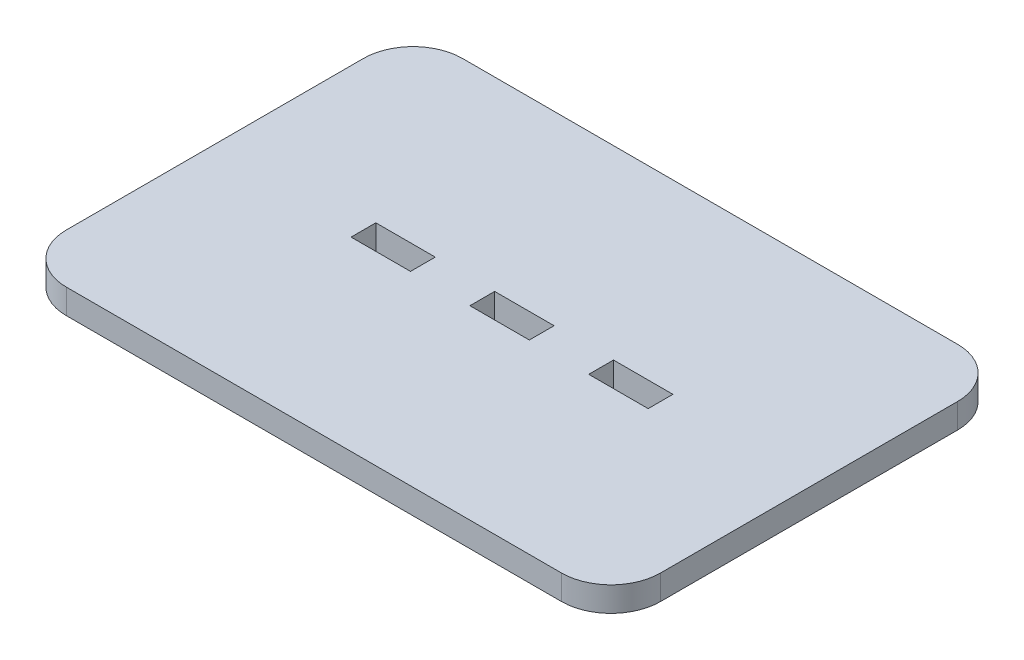
ISO-10303-21;
HEADER;
FILE_DESCRIPTION(('STEP AP214'),'2;1');
FILE_NAME('part.step','',(''),(''),'','','');
FILE_SCHEMA(('AUTOMOTIVE_DESIGN { 1 0 10303 214 1 1 1 1 }'));
ENDSEC;
DATA;
#1=APPLICATION_CONTEXT('core data for automotive mechanical design processes');
#2=APPLICATION_PROTOCOL_DEFINITION('international standard','automotive_design',2000,#1);
#3=PRODUCT_CONTEXT('',#1,'mechanical');
#4=PRODUCT('Part','Part','',(#3));
#5=PRODUCT_RELATED_PRODUCT_CATEGORY('part','',(#4));
#6=PRODUCT_DEFINITION_FORMATION('','',#4);
#7=PRODUCT_DEFINITION_CONTEXT('part definition',#1,'design');
#8=PRODUCT_DEFINITION('design','',#6,#7);
#9=PRODUCT_DEFINITION_SHAPE('','',#8);
#10=(LENGTH_UNIT() NAMED_UNIT(*) SI_UNIT(.MILLI.,.METRE.));
#11=(NAMED_UNIT(*) PLANE_ANGLE_UNIT() SI_UNIT($,.RADIAN.));
#12=(NAMED_UNIT(*) SI_UNIT($,.STERADIAN.) SOLID_ANGLE_UNIT());
#13=UNCERTAINTY_MEASURE_WITH_UNIT(LENGTH_MEASURE(1.E-05),#10,'distance_accuracy_value','');
#14=(GEOMETRIC_REPRESENTATION_CONTEXT(3) GLOBAL_UNCERTAINTY_ASSIGNED_CONTEXT((#13)) GLOBAL_UNIT_ASSIGNED_CONTEXT((#10,
#11,#12)) REPRESENTATION_CONTEXT('',''));
#15=CARTESIAN_POINT('',(0.,0.,0.));
#16=DIRECTION('',(0.,0.,1.));
#17=DIRECTION('',(1.,0.,0.));
#18=AXIS2_PLACEMENT_3D('',#15,#16,#17);
#19=CARTESIAN_POINT('',(50.,5.,-30.));
#20=DIRECTION('',(0.,-1.,0.));
#21=DIRECTION('',(0.,0.,-1.));
#22=AXIS2_PLACEMENT_3D('',#19,#20,#21);
#23=PLANE('',#22);
#24=DIRECTION('',(0.,0.,1.));
#25=VECTOR('',#24,1.);
#26=CARTESIAN_POINT('',(-30.,5.,-2.50000000000001));
#27=LINE('',#26,#25);
#28=CARTESIAN_POINT('',(-30.,5.,-2.50000000000001));
#29=VERTEX_POINT('',#28);
#30=CARTESIAN_POINT('',(-30.,5.,2.49999999999999));
#31=VERTEX_POINT('',#30);
#32=EDGE_CURVE('E205',#29,#31,#27,.T.);
#33=ORIENTED_EDGE('',*,*,#32,.F.);
#34=DIRECTION('',(-1.,0.,0.));
#35=VECTOR('',#34,1.);
#36=CARTESIAN_POINT('',(-30.,5.,-2.50000000000001));
#37=LINE('',#36,#35);
#38=CARTESIAN_POINT('',(-18.,5.,-2.50000000000002));
#39=VERTEX_POINT('',#38);
#40=EDGE_CURVE('E213',#39,#29,#37,.T.);
#41=ORIENTED_EDGE('',*,*,#40,.F.);
#42=DIRECTION('',(0.,0.,-1.));
#43=VECTOR('',#42,1.);
#44=CARTESIAN_POINT('',(-18.,5.,-2.50000000000001));
#45=LINE('',#44,#43);
#46=CARTESIAN_POINT('',(-18.,5.,2.49999999999999));
#47=VERTEX_POINT('',#46);
#48=EDGE_CURVE('E210',#47,#39,#45,.T.);
#49=ORIENTED_EDGE('',*,*,#48,.F.);
#50=DIRECTION('',(1.,0.,0.));
#51=VECTOR('',#50,1.);
#52=CARTESIAN_POINT('',(-30.,5.,2.49999999999999));
#53=LINE('',#52,#51);
#54=EDGE_CURVE('E207',#31,#47,#53,.T.);
#55=ORIENTED_EDGE('',*,*,#54,.F.);
#56=EDGE_LOOP('',(#33,#41,#49,#55));
#57=FACE_BOUND('',#56,.T.);
#58=CARTESIAN_POINT('',(50.,5.,-30.));
#59=DIRECTION('',(0.,1.,0.));
#60=DIRECTION('',(0.,0.,-1.));
#61=AXIS2_PLACEMENT_3D('',#58,#59,#60);
#62=CIRCLE('',#61,10.);
#63=CARTESIAN_POINT('',(60.,5.,-29.9999999999999));
#64=VERTEX_POINT('',#63);
#65=CARTESIAN_POINT('',(49.9999999999999,5.,-40.));
#66=VERTEX_POINT('',#65);
#67=EDGE_CURVE('E267',#64,#66,#62,.T.);
#68=ORIENTED_EDGE('',*,*,#67,.T.);
#69=DIRECTION('',(-1.,0.,0.));
#70=VECTOR('',#69,1.);
#71=CARTESIAN_POINT('',(-49.9999999999999,5.,-40.));
#72=LINE('',#71,#70);
#73=CARTESIAN_POINT('',(-49.9999999999999,5.,-40.));
#74=VERTEX_POINT('',#73);
#75=EDGE_CURVE('E270',#66,#74,#72,.T.);
#76=ORIENTED_EDGE('',*,*,#75,.T.);
#77=CARTESIAN_POINT('',(-50.,5.,-30.));
#78=DIRECTION('',(0.,1.,0.));
#79=DIRECTION('',(0.,0.,1.));
#80=AXIS2_PLACEMENT_3D('',#77,#78,#79);
#81=CIRCLE('',#80,10.);
#82=CARTESIAN_POINT('',(-60.,5.,-29.9999999999999));
#83=VERTEX_POINT('',#82);
#84=EDGE_CURVE('E273',#74,#83,#81,.T.);
#85=ORIENTED_EDGE('',*,*,#84,.T.);
#86=DIRECTION('',(0.,0.,1.));
#87=VECTOR('',#86,1.);
#88=CARTESIAN_POINT('',(-60.,5.,-29.9999999999999));
#89=LINE('',#88,#87);
#90=CARTESIAN_POINT('',(-60.,5.,29.9999999999999));
#91=VERTEX_POINT('',#90);
#92=EDGE_CURVE('E275',#83,#91,#89,.T.);
#93=ORIENTED_EDGE('',*,*,#92,.T.);
#94=CARTESIAN_POINT('',(-50.,5.,30.));
#95=DIRECTION('',(0.,1.,0.));
#96=DIRECTION('',(0.,0.,-1.));
#97=AXIS2_PLACEMENT_3D('',#94,#95,#96);
#98=CIRCLE('',#97,10.);
#99=CARTESIAN_POINT('',(-49.9999999999999,5.,40.));
#100=VERTEX_POINT('',#99);
#101=EDGE_CURVE('E277',#91,#100,#98,.T.);
#102=ORIENTED_EDGE('',*,*,#101,.T.);
#103=DIRECTION('',(1.,0.,0.));
#104=VECTOR('',#103,1.);
#105=CARTESIAN_POINT('',(-49.9999999999999,5.,40.));
#106=LINE('',#105,#104);
#107=CARTESIAN_POINT('',(49.9999999999999,5.,40.));
#108=VERTEX_POINT('',#107);
#109=EDGE_CURVE('E279',#100,#108,#106,.T.);
#110=ORIENTED_EDGE('',*,*,#109,.T.);
#111=CARTESIAN_POINT('',(50.,5.,30.));
#112=DIRECTION('',(0.,1.,0.));
#113=DIRECTION('',(0.,0.,-1.));
#114=AXIS2_PLACEMENT_3D('',#111,#112,#113);
#115=CIRCLE('',#114,10.);
#116=CARTESIAN_POINT('',(60.,5.,29.9999999999999));
#117=VERTEX_POINT('',#116);
#118=EDGE_CURVE('E281',#108,#117,#115,.T.);
#119=ORIENTED_EDGE('',*,*,#118,.T.);
#120=DIRECTION('',(0.,0.,-1.));
#121=VECTOR('',#120,1.);
#122=CARTESIAN_POINT('',(60.,5.,-29.9999999999999));
#123=LINE('',#122,#121);
#124=EDGE_CURVE('E283',#117,#64,#123,.T.);
#125=ORIENTED_EDGE('',*,*,#124,.T.);
#126=EDGE_LOOP('',(#68,#76,#85,#93,#102,#110,#119,#125));
#127=FACE_BOUND('',#126,.T.);
#128=DIRECTION('',(1.,0.,0.));
#129=VECTOR('',#128,1.);
#130=CARTESIAN_POINT('',(18.,5.,2.49999999999999));
#131=LINE('',#130,#129);
#132=CARTESIAN_POINT('',(18.,5.,2.49999999999999));
#133=VERTEX_POINT('',#132);
#134=CARTESIAN_POINT('',(30.,5.,2.49999999999999));
#135=VERTEX_POINT('',#134);
#136=EDGE_CURVE('E236',#133,#135,#131,.T.);
#137=ORIENTED_EDGE('',*,*,#136,.F.);
#138=DIRECTION('',(0.,0.,1.));
#139=VECTOR('',#138,1.);
#140=CARTESIAN_POINT('',(18.,5.,-2.50000000000001));
#141=LINE('',#140,#139);
#142=CARTESIAN_POINT('',(18.,5.,-2.50000000000001));
#143=VERTEX_POINT('',#142);
#144=EDGE_CURVE('E244',#143,#133,#141,.T.);
#145=ORIENTED_EDGE('',*,*,#144,.F.);
#146=DIRECTION('',(-1.,0.,0.));
#147=VECTOR('',#146,1.);
#148=CARTESIAN_POINT('',(18.,5.,-2.50000000000001));
#149=LINE('',#148,#147);
#150=CARTESIAN_POINT('',(30.,5.,-2.50000000000001));
#151=VERTEX_POINT('',#150);
#152=EDGE_CURVE('E241',#151,#143,#149,.T.);
#153=ORIENTED_EDGE('',*,*,#152,.F.);
#154=DIRECTION('',(0.,0.,-1.));
#155=VECTOR('',#154,1.);
#156=CARTESIAN_POINT('',(30.,5.,-2.50000000000001));
#157=LINE('',#156,#155);
#158=EDGE_CURVE('E238',#135,#151,#157,.T.);
#159=ORIENTED_EDGE('',*,*,#158,.F.);
#160=EDGE_LOOP('',(#137,#145,#153,#159));
#161=FACE_BOUND('',#160,.T.);
#162=DIRECTION('',(1.,0.,0.));
#163=VECTOR('',#162,1.);
#164=CARTESIAN_POINT('',(-6.00000000000001,5.,2.49999999999999));
#165=LINE('',#164,#163);
#166=CARTESIAN_POINT('',(-6.00000000000001,5.,2.49999999999999));
#167=VERTEX_POINT('',#166);
#168=CARTESIAN_POINT('',(5.99999999999999,5.,2.49999999999999));
#169=VERTEX_POINT('',#168);
#170=EDGE_CURVE('E169',#167,#169,#165,.T.);
#171=ORIENTED_EDGE('',*,*,#170,.F.);
#172=DIRECTION('',(0.,0.,1.));
#173=VECTOR('',#172,1.);
#174=CARTESIAN_POINT('',(-6.00000000000001,5.,-2.50000000000001));
#175=LINE('',#174,#173);
#176=CARTESIAN_POINT('',(-6.00000000000001,5.,-2.50000000000001));
#177=VERTEX_POINT('',#176);
#178=EDGE_CURVE('E191',#177,#167,#175,.T.);
#179=ORIENTED_EDGE('',*,*,#178,.F.);
#180=DIRECTION('',(-1.,0.,0.));
#181=VECTOR('',#180,1.);
#182=CARTESIAN_POINT('',(-6.00000000000001,5.,-2.50000000000001));
#183=LINE('',#182,#181);
#184=CARTESIAN_POINT('',(5.99999999999999,5.,-2.50000000000001));
#185=VERTEX_POINT('',#184);
#186=EDGE_CURVE('E189',#185,#177,#183,.T.);
#187=ORIENTED_EDGE('',*,*,#186,.F.);
#188=DIRECTION('',(0.,0.,-1.));
#189=VECTOR('',#188,1.);
#190=CARTESIAN_POINT('',(5.99999999999999,5.,-2.50000000000001));
#191=LINE('',#190,#189);
#192=EDGE_CURVE('E177',#169,#185,#191,.T.);
#193=ORIENTED_EDGE('',*,*,#192,.F.);
#194=EDGE_LOOP('',(#171,#179,#187,#193));
#195=FACE_BOUND('',#194,.T.);
#196=ADVANCED_FACE('F32',(#57,#127,#161,#195),#23,.F.);
#197=CARTESIAN_POINT('',(50.,0.,-30.));
#198=DIRECTION('',(0.,-1.,0.));
#199=DIRECTION('',(0.,0.,-1.));
#200=AXIS2_PLACEMENT_3D('',#197,#198,#199);
#201=PLANE('',#200);
#202=CARTESIAN_POINT('',(50.,0.,-30.));
#203=DIRECTION('',(0.,1.,0.));
#204=DIRECTION('',(0.,0.,-1.));
#205=AXIS2_PLACEMENT_3D('',#202,#203,#204);
#206=CIRCLE('',#205,10.);
#207=CARTESIAN_POINT('',(60.,0.,-29.9999999999999));
#208=VERTEX_POINT('',#207);
#209=CARTESIAN_POINT('',(49.9999999999999,0.,-40.));
#210=VERTEX_POINT('',#209);
#211=EDGE_CURVE('E266',#208,#210,#206,.T.);
#212=ORIENTED_EDGE('',*,*,#211,.F.);
#213=DIRECTION('',(0.,0.,-1.));
#214=VECTOR('',#213,1.);
#215=CARTESIAN_POINT('',(60.,0.,-29.9999999999999));
#216=LINE('',#215,#214);
#217=CARTESIAN_POINT('',(60.,0.,29.9999999999999));
#218=VERTEX_POINT('',#217);
#219=EDGE_CURVE('E271',#218,#208,#216,.T.);
#220=ORIENTED_EDGE('',*,*,#219,.F.);
#221=CARTESIAN_POINT('',(50.,0.,30.));
#222=DIRECTION('',(0.,1.,0.));
#223=DIRECTION('',(0.,0.,-1.));
#224=AXIS2_PLACEMENT_3D('',#221,#222,#223);
#225=CIRCLE('',#224,10.);
#226=CARTESIAN_POINT('',(49.9999999999999,0.,40.));
#227=VERTEX_POINT('',#226);
#228=EDGE_CURVE('E298',#227,#218,#225,.T.);
#229=ORIENTED_EDGE('',*,*,#228,.F.);
#230=DIRECTION('',(1.,0.,0.));
#231=VECTOR('',#230,1.);
#232=CARTESIAN_POINT('',(-49.9999999999999,0.,40.));
#233=LINE('',#232,#231);
#234=CARTESIAN_POINT('',(-49.9999999999999,0.,40.));
#235=VERTEX_POINT('',#234);
#236=EDGE_CURVE('E296',#235,#227,#233,.T.);
#237=ORIENTED_EDGE('',*,*,#236,.F.);
#238=CARTESIAN_POINT('',(-50.,0.,30.));
#239=DIRECTION('',(0.,1.,0.));
#240=DIRECTION('',(0.,0.,-1.));
#241=AXIS2_PLACEMENT_3D('',#238,#239,#240);
#242=CIRCLE('',#241,10.);
#243=CARTESIAN_POINT('',(-60.,0.,29.9999999999999));
#244=VERTEX_POINT('',#243);
#245=EDGE_CURVE('E294',#244,#235,#242,.T.);
#246=ORIENTED_EDGE('',*,*,#245,.F.);
#247=DIRECTION('',(0.,0.,1.));
#248=VECTOR('',#247,1.);
#249=CARTESIAN_POINT('',(-60.,0.,-29.9999999999999));
#250=LINE('',#249,#248);
#251=CARTESIAN_POINT('',(-60.,0.,-29.9999999999999));
#252=VERTEX_POINT('',#251);
#253=EDGE_CURVE('E292',#252,#244,#250,.T.);
#254=ORIENTED_EDGE('',*,*,#253,.F.);
#255=CARTESIAN_POINT('',(-50.,0.,-30.));
#256=DIRECTION('',(0.,1.,0.));
#257=DIRECTION('',(0.,0.,1.));
#258=AXIS2_PLACEMENT_3D('',#255,#256,#257);
#259=CIRCLE('',#258,10.);
#260=CARTESIAN_POINT('',(-49.9999999999999,0.,-40.));
#261=VERTEX_POINT('',#260);
#262=EDGE_CURVE('E290',#261,#252,#259,.T.);
#263=ORIENTED_EDGE('',*,*,#262,.F.);
#264=DIRECTION('',(-1.,0.,0.));
#265=VECTOR('',#264,1.);
#266=CARTESIAN_POINT('',(-49.9999999999999,0.,-40.));
#267=LINE('',#266,#265);
#268=EDGE_CURVE('E288',#210,#261,#267,.T.);
#269=ORIENTED_EDGE('',*,*,#268,.F.);
#270=EDGE_LOOP('',(#212,#220,#229,#237,#246,#254,#263,#269));
#271=FACE_BOUND('',#270,.T.);
#272=DIRECTION('',(0.,0.,1.));
#273=VECTOR('',#272,1.);
#274=CARTESIAN_POINT('',(18.,0.,-2.50000000000001));
#275=LINE('',#274,#273);
#276=CARTESIAN_POINT('',(18.,0.,-2.50000000000001));
#277=VERTEX_POINT('',#276);
#278=CARTESIAN_POINT('',(18.,0.,2.49999999999998));
#279=VERTEX_POINT('',#278);
#280=EDGE_CURVE('E239',#277,#279,#275,.T.);
#281=ORIENTED_EDGE('',*,*,#280,.T.);
#282=DIRECTION('',(1.,0.,0.));
#283=VECTOR('',#282,1.);
#284=CARTESIAN_POINT('',(18.,0.,2.49999999999999));
#285=LINE('',#284,#283);
#286=CARTESIAN_POINT('',(30.,0.,2.49999999999999));
#287=VERTEX_POINT('',#286);
#288=EDGE_CURVE('E235',#279,#287,#285,.T.);
#289=ORIENTED_EDGE('',*,*,#288,.T.);
#290=DIRECTION('',(0.,0.,-1.));
#291=VECTOR('',#290,1.);
#292=CARTESIAN_POINT('',(30.,0.,-2.50000000000001));
#293=LINE('',#292,#291);
#294=CARTESIAN_POINT('',(30.,0.,-2.50000000000001));
#295=VERTEX_POINT('',#294);
#296=EDGE_CURVE('E249',#287,#295,#293,.T.);
#297=ORIENTED_EDGE('',*,*,#296,.T.);
#298=DIRECTION('',(-1.,0.,0.));
#299=VECTOR('',#298,1.);
#300=CARTESIAN_POINT('',(18.,0.,-2.50000000000001));
#301=LINE('',#300,#299);
#302=EDGE_CURVE('E252',#295,#277,#301,.T.);
#303=ORIENTED_EDGE('',*,*,#302,.T.);
#304=EDGE_LOOP('',(#281,#289,#297,#303));
#305=FACE_BOUND('',#304,.T.);
#306=DIRECTION('',(-1.,0.,0.));
#307=VECTOR('',#306,1.);
#308=CARTESIAN_POINT('',(-30.,0.,-2.50000000000001));
#309=LINE('',#308,#307);
#310=CARTESIAN_POINT('',(-18.,0.,-2.50000000000001));
#311=VERTEX_POINT('',#310);
#312=CARTESIAN_POINT('',(-30.,0.,-2.50000000000002));
#313=VERTEX_POINT('',#312);
#314=EDGE_CURVE('E208',#311,#313,#309,.T.);
#315=ORIENTED_EDGE('',*,*,#314,.T.);
#316=DIRECTION('',(0.,0.,1.));
#317=VECTOR('',#316,1.);
#318=CARTESIAN_POINT('',(-30.,0.,-2.50000000000001));
#319=LINE('',#318,#317);
#320=CARTESIAN_POINT('',(-30.,0.,2.49999999999999));
#321=VERTEX_POINT('',#320);
#322=EDGE_CURVE('E185',#313,#321,#319,.T.);
#323=ORIENTED_EDGE('',*,*,#322,.T.);
#324=DIRECTION('',(1.,0.,0.));
#325=VECTOR('',#324,1.);
#326=CARTESIAN_POINT('',(-30.,0.,2.49999999999999));
#327=LINE('',#326,#325);
#328=CARTESIAN_POINT('',(-18.,0.,2.49999999999999));
#329=VERTEX_POINT('',#328);
#330=EDGE_CURVE('E218',#321,#329,#327,.T.);
#331=ORIENTED_EDGE('',*,*,#330,.T.);
#332=DIRECTION('',(0.,0.,-1.));
#333=VECTOR('',#332,1.);
#334=CARTESIAN_POINT('',(-18.,0.,-2.50000000000001));
#335=LINE('',#334,#333);
#336=EDGE_CURVE('E221',#329,#311,#335,.T.);
#337=ORIENTED_EDGE('',*,*,#336,.T.);
#338=EDGE_LOOP('',(#315,#323,#331,#337));
#339=FACE_BOUND('',#338,.T.);
#340=DIRECTION('',(0.,0.,1.));
#341=VECTOR('',#340,1.);
#342=CARTESIAN_POINT('',(-6.00000000000001,0.,-2.50000000000001));
#343=LINE('',#342,#341);
#344=CARTESIAN_POINT('',(-6.00000000000001,0.,-2.50000000000001));
#345=VERTEX_POINT('',#344);
#346=CARTESIAN_POINT('',(-6.00000000000001,0.,2.49999999999998));
#347=VERTEX_POINT('',#346);
#348=EDGE_CURVE('E178',#345,#347,#343,.T.);
#349=ORIENTED_EDGE('',*,*,#348,.T.);
#350=DIRECTION('',(1.,0.,0.));
#351=VECTOR('',#350,1.);
#352=CARTESIAN_POINT('',(-6.00000000000001,0.,2.49999999999999));
#353=LINE('',#352,#351);
#354=CARTESIAN_POINT('',(5.99999999999999,0.,2.49999999999999));
#355=VERTEX_POINT('',#354);
#356=EDGE_CURVE('E55',#347,#355,#353,.T.);
#357=ORIENTED_EDGE('',*,*,#356,.T.);
#358=DIRECTION('',(0.,0.,-1.));
#359=VECTOR('',#358,1.);
#360=CARTESIAN_POINT('',(5.99999999999999,0.,-2.50000000000001));
#361=LINE('',#360,#359);
#362=CARTESIAN_POINT('',(5.99999999999999,0.,-2.50000000000001));
#363=VERTEX_POINT('',#362);
#364=EDGE_CURVE('E184',#355,#363,#361,.T.);
#365=ORIENTED_EDGE('',*,*,#364,.T.);
#366=DIRECTION('',(-1.,0.,0.));
#367=VECTOR('',#366,1.);
#368=CARTESIAN_POINT('',(-6.00000000000001,0.,-2.50000000000001));
#369=LINE('',#368,#367);
#370=EDGE_CURVE('E197',#363,#345,#369,.T.);
#371=ORIENTED_EDGE('',*,*,#370,.T.);
#372=EDGE_LOOP('',(#349,#357,#365,#371));
#373=FACE_BOUND('',#372,.T.);
#374=ADVANCED_FACE('F328',(#271,#305,#339,#373),#201,.T.);
#375=CARTESIAN_POINT('',(50.,5.,-30.));
#376=DIRECTION('',(0.,-1.,0.));
#377=DIRECTION('',(0.,0.,-1.));
#378=AXIS2_PLACEMENT_3D('',#375,#376,#377);
#379=CYLINDRICAL_SURFACE('',#378,10.);
#380=ORIENTED_EDGE('',*,*,#211,.T.);
#381=DIRECTION('',(0.,-1.,0.));
#382=VECTOR('',#381,1.);
#383=CARTESIAN_POINT('',(49.9999999999999,5.,-40.));
#384=LINE('',#383,#382);
#385=EDGE_CURVE('E11',#66,#210,#384,.T.);
#386=ORIENTED_EDGE('',*,*,#385,.F.);
#387=ORIENTED_EDGE('',*,*,#67,.F.);
#388=DIRECTION('',(0.,-1.,0.));
#389=VECTOR('',#388,1.);
#390=CARTESIAN_POINT('',(60.,5.,-29.9999999999999));
#391=LINE('',#390,#389);
#392=EDGE_CURVE('E285',#64,#208,#391,.T.);
#393=ORIENTED_EDGE('',*,*,#392,.T.);
#394=EDGE_LOOP('',(#380,#386,#387,#393));
#395=FACE_BOUND('',#394,.T.);
#396=ADVANCED_FACE('F34',(#395),#379,.T.);
#397=CARTESIAN_POINT('',(-49.9999999999999,5.,-40.));
#398=DIRECTION('',(0.,0.,1.));
#399=DIRECTION('',(1.,0.,0.));
#400=AXIS2_PLACEMENT_3D('',#397,#398,#399);
#401=PLANE('',#400);
#402=ORIENTED_EDGE('',*,*,#268,.T.);
#403=DIRECTION('',(0.,-1.,0.));
#404=VECTOR('',#403,1.);
#405=CARTESIAN_POINT('',(-49.9999999999999,5.,-40.));
#406=LINE('',#405,#404);
#407=EDGE_CURVE('E40',#74,#261,#406,.T.);
#408=ORIENTED_EDGE('',*,*,#407,.F.);
#409=ORIENTED_EDGE('',*,*,#75,.F.);
#410=ORIENTED_EDGE('',*,*,#385,.T.);
#411=EDGE_LOOP('',(#402,#408,#409,#410));
#412=FACE_BOUND('',#411,.T.);
#413=ADVANCED_FACE('F346',(#412),#401,.F.);
#414=CARTESIAN_POINT('',(-50.,5.,-30.));
#415=DIRECTION('',(0.,-1.,0.));
#416=DIRECTION('',(0.,0.,-1.));
#417=AXIS2_PLACEMENT_3D('',#414,#415,#416);
#418=CYLINDRICAL_SURFACE('',#417,10.);
#419=ORIENTED_EDGE('',*,*,#262,.T.);
#420=DIRECTION('',(0.,-1.,0.));
#421=VECTOR('',#420,1.);
#422=CARTESIAN_POINT('',(-60.,5.,-29.9999999999999));
#423=LINE('',#422,#421);
#424=EDGE_CURVE('E315',#83,#252,#423,.T.);
#425=ORIENTED_EDGE('',*,*,#424,.F.);
#426=ORIENTED_EDGE('',*,*,#84,.F.);
#427=ORIENTED_EDGE('',*,*,#407,.T.);
#428=EDGE_LOOP('',(#419,#425,#426,#427));
#429=FACE_BOUND('',#428,.T.);
#430=ADVANCED_FACE('F322',(#429),#418,.T.);
#431=CARTESIAN_POINT('',(-60.,5.,-29.9999999999999));
#432=DIRECTION('',(1.,0.,0.));
#433=DIRECTION('',(0.,0.,-1.));
#434=AXIS2_PLACEMENT_3D('',#431,#432,#433);
#435=PLANE('',#434);
#436=ORIENTED_EDGE('',*,*,#253,.T.);
#437=DIRECTION('',(0.,-1.,0.));
#438=VECTOR('',#437,1.);
#439=CARTESIAN_POINT('',(-60.,5.,29.9999999999999));
#440=LINE('',#439,#438);
#441=EDGE_CURVE('E312',#91,#244,#440,.T.);
#442=ORIENTED_EDGE('',*,*,#441,.F.);
#443=ORIENTED_EDGE('',*,*,#92,.F.);
#444=ORIENTED_EDGE('',*,*,#424,.T.);
#445=EDGE_LOOP('',(#436,#442,#443,#444));
#446=FACE_BOUND('',#445,.T.);
#447=ADVANCED_FACE('F334',(#446),#435,.F.);
#448=CARTESIAN_POINT('',(-50.,5.,30.));
#449=DIRECTION('',(0.,-1.,0.));
#450=DIRECTION('',(0.,0.,-1.));
#451=AXIS2_PLACEMENT_3D('',#448,#449,#450);
#452=CYLINDRICAL_SURFACE('',#451,10.);
#453=ORIENTED_EDGE('',*,*,#245,.T.);
#454=DIRECTION('',(0.,-1.,0.));
#455=VECTOR('',#454,1.);
#456=CARTESIAN_POINT('',(-49.9999999999999,5.,40.));
#457=LINE('',#456,#455);
#458=EDGE_CURVE('E309',#100,#235,#457,.T.);
#459=ORIENTED_EDGE('',*,*,#458,.F.);
#460=ORIENTED_EDGE('',*,*,#101,.F.);
#461=ORIENTED_EDGE('',*,*,#441,.T.);
#462=EDGE_LOOP('',(#453,#459,#460,#461));
#463=FACE_BOUND('',#462,.T.);
#464=ADVANCED_FACE('F338',(#463),#452,.T.);
#465=CARTESIAN_POINT('',(-49.9999999999999,5.,40.));
#466=DIRECTION('',(0.,0.,-1.));
#467=DIRECTION('',(-1.,0.,0.));
#468=AXIS2_PLACEMENT_3D('',#465,#466,#467);
#469=PLANE('',#468);
#470=ORIENTED_EDGE('',*,*,#236,.T.);
#471=DIRECTION('',(0.,-1.,0.));
#472=VECTOR('',#471,1.);
#473=CARTESIAN_POINT('',(49.9999999999999,5.,40.));
#474=LINE('',#473,#472);
#475=EDGE_CURVE('E306',#108,#227,#474,.T.);
#476=ORIENTED_EDGE('',*,*,#475,.F.);
#477=ORIENTED_EDGE('',*,*,#109,.F.);
#478=ORIENTED_EDGE('',*,*,#458,.T.);
#479=EDGE_LOOP('',(#470,#476,#477,#478));
#480=FACE_BOUND('',#479,.T.);
#481=ADVANCED_FACE('F359',(#480),#469,.F.);
#482=CARTESIAN_POINT('',(50.,5.,30.));
#483=DIRECTION('',(0.,-1.,0.));
#484=DIRECTION('',(0.,0.,-1.));
#485=AXIS2_PLACEMENT_3D('',#482,#483,#484);
#486=CYLINDRICAL_SURFACE('',#485,10.);
#487=ORIENTED_EDGE('',*,*,#228,.T.);
#488=DIRECTION('',(0.,-1.,0.));
#489=VECTOR('',#488,1.);
#490=CARTESIAN_POINT('',(60.,5.,29.9999999999999));
#491=LINE('',#490,#489);
#492=EDGE_CURVE('E303',#117,#218,#491,.T.);
#493=ORIENTED_EDGE('',*,*,#492,.F.);
#494=ORIENTED_EDGE('',*,*,#118,.F.);
#495=ORIENTED_EDGE('',*,*,#475,.T.);
#496=EDGE_LOOP('',(#487,#493,#494,#495));
#497=FACE_BOUND('',#496,.T.);
#498=ADVANCED_FACE('F357',(#497),#486,.T.);
#499=CARTESIAN_POINT('',(60.,5.,-29.9999999999999));
#500=DIRECTION('',(-1.,0.,0.));
#501=DIRECTION('',(0.,0.,1.));
#502=AXIS2_PLACEMENT_3D('',#499,#500,#501);
#503=PLANE('',#502);
#504=ORIENTED_EDGE('',*,*,#219,.T.);
#505=ORIENTED_EDGE('',*,*,#392,.F.);
#506=ORIENTED_EDGE('',*,*,#124,.F.);
#507=ORIENTED_EDGE('',*,*,#492,.T.);
#508=EDGE_LOOP('',(#504,#505,#506,#507));
#509=FACE_BOUND('',#508,.T.);
#510=ADVANCED_FACE('F352',(#509),#503,.F.);
#511=CARTESIAN_POINT('',(18.,5.,2.49999999999999));
#512=DIRECTION('',(0.,0.,-1.));
#513=DIRECTION('',(-1.,0.,0.));
#514=AXIS2_PLACEMENT_3D('',#511,#512,#513);
#515=PLANE('',#514);
#516=ORIENTED_EDGE('',*,*,#288,.F.);
#517=DIRECTION('',(0.,-1.,0.));
#518=VECTOR('',#517,1.);
#519=CARTESIAN_POINT('',(18.,5.,2.49999999999999));
#520=LINE('',#519,#518);
#521=EDGE_CURVE('E246',#133,#279,#520,.T.);
#522=ORIENTED_EDGE('',*,*,#521,.F.);
#523=ORIENTED_EDGE('',*,*,#136,.T.);
#524=DIRECTION('',(0.,-1.,0.));
#525=VECTOR('',#524,1.);
#526=CARTESIAN_POINT('',(30.,5.,2.49999999999999));
#527=LINE('',#526,#525);
#528=EDGE_CURVE('E263',#135,#287,#527,.T.);
#529=ORIENTED_EDGE('',*,*,#528,.T.);
#530=EDGE_LOOP('',(#516,#522,#523,#529));
#531=FACE_BOUND('',#530,.T.);
#532=ADVANCED_FACE('F377',(#531),#515,.T.);
#533=CARTESIAN_POINT('',(30.,5.,-2.50000000000001));
#534=DIRECTION('',(-1.,0.,0.));
#535=DIRECTION('',(0.,0.,1.));
#536=AXIS2_PLACEMENT_3D('',#533,#534,#535);
#537=PLANE('',#536);
#538=ORIENTED_EDGE('',*,*,#296,.F.);
#539=ORIENTED_EDGE('',*,*,#528,.F.);
#540=ORIENTED_EDGE('',*,*,#158,.T.);
#541=DIRECTION('',(0.,-1.,0.));
#542=VECTOR('',#541,1.);
#543=CARTESIAN_POINT('',(30.,5.,-2.50000000000001));
#544=LINE('',#543,#542);
#545=EDGE_CURVE('E261',#151,#295,#544,.T.);
#546=ORIENTED_EDGE('',*,*,#545,.T.);
#547=EDGE_LOOP('',(#538,#539,#540,#546));
#548=FACE_BOUND('',#547,.T.);
#549=ADVANCED_FACE('F384',(#548),#537,.T.);
#550=CARTESIAN_POINT('',(18.,5.,-2.50000000000001));
#551=DIRECTION('',(0.,0.,1.));
#552=DIRECTION('',(1.,0.,0.));
#553=AXIS2_PLACEMENT_3D('',#550,#551,#552);
#554=PLANE('',#553);
#555=ORIENTED_EDGE('',*,*,#302,.F.);
#556=ORIENTED_EDGE('',*,*,#545,.F.);
#557=ORIENTED_EDGE('',*,*,#152,.T.);
#558=DIRECTION('',(0.,-1.,0.));
#559=VECTOR('',#558,1.);
#560=CARTESIAN_POINT('',(18.,5.,-2.50000000000001));
#561=LINE('',#560,#559);
#562=EDGE_CURVE('E259',#143,#277,#561,.T.);
#563=ORIENTED_EDGE('',*,*,#562,.T.);
#564=EDGE_LOOP('',(#555,#556,#557,#563));
#565=FACE_BOUND('',#564,.T.);
#566=ADVANCED_FACE('F389',(#565),#554,.T.);
#567=CARTESIAN_POINT('',(18.,5.,-2.50000000000001));
#568=DIRECTION('',(1.,0.,0.));
#569=DIRECTION('',(0.,0.,-1.));
#570=AXIS2_PLACEMENT_3D('',#567,#568,#569);
#571=PLANE('',#570);
#572=ORIENTED_EDGE('',*,*,#280,.F.);
#573=ORIENTED_EDGE('',*,*,#562,.F.);
#574=ORIENTED_EDGE('',*,*,#144,.T.);
#575=ORIENTED_EDGE('',*,*,#521,.T.);
#576=EDGE_LOOP('',(#572,#573,#574,#575));
#577=FACE_BOUND('',#576,.T.);
#578=ADVANCED_FACE('F396',(#577),#571,.T.);
#579=CARTESIAN_POINT('',(-30.,5.,-2.50000000000001));
#580=DIRECTION('',(1.,0.,0.));
#581=DIRECTION('',(0.,0.,-1.));
#582=AXIS2_PLACEMENT_3D('',#579,#580,#581);
#583=PLANE('',#582);
#584=ORIENTED_EDGE('',*,*,#322,.F.);
#585=DIRECTION('',(0.,-1.,0.));
#586=VECTOR('',#585,1.);
#587=CARTESIAN_POINT('',(-30.,5.,-2.50000000000001));
#588=LINE('',#587,#586);
#589=EDGE_CURVE('E215',#29,#313,#588,.T.);
#590=ORIENTED_EDGE('',*,*,#589,.F.);
#591=ORIENTED_EDGE('',*,*,#32,.T.);
#592=DIRECTION('',(0.,-1.,0.));
#593=VECTOR('',#592,1.);
#594=CARTESIAN_POINT('',(-30.,5.,2.49999999999999));
#595=LINE('',#594,#593);
#596=EDGE_CURVE('E232',#31,#321,#595,.T.);
#597=ORIENTED_EDGE('',*,*,#596,.T.);
#598=EDGE_LOOP('',(#584,#590,#591,#597));
#599=FACE_BOUND('',#598,.T.);
#600=ADVANCED_FACE('F409',(#599),#583,.T.);
#601=CARTESIAN_POINT('',(-30.,5.,2.49999999999999));
#602=DIRECTION('',(0.,0.,-1.));
#603=DIRECTION('',(-1.,0.,0.));
#604=AXIS2_PLACEMENT_3D('',#601,#602,#603);
#605=PLANE('',#604);
#606=ORIENTED_EDGE('',*,*,#330,.F.);
#607=ORIENTED_EDGE('',*,*,#596,.F.);
#608=ORIENTED_EDGE('',*,*,#54,.T.);
#609=DIRECTION('',(0.,-1.,0.));
#610=VECTOR('',#609,1.);
#611=CARTESIAN_POINT('',(-18.,5.,2.49999999999999));
#612=LINE('',#611,#610);
#613=EDGE_CURVE('E230',#47,#329,#612,.T.);
#614=ORIENTED_EDGE('',*,*,#613,.T.);
#615=EDGE_LOOP('',(#606,#607,#608,#614));
#616=FACE_BOUND('',#615,.T.);
#617=ADVANCED_FACE('F414',(#616),#605,.T.);
#618=CARTESIAN_POINT('',(-18.,5.,-2.50000000000001));
#619=DIRECTION('',(-1.,0.,0.));
#620=DIRECTION('',(0.,0.,1.));
#621=AXIS2_PLACEMENT_3D('',#618,#619,#620);
#622=PLANE('',#621);
#623=ORIENTED_EDGE('',*,*,#336,.F.);
#624=ORIENTED_EDGE('',*,*,#613,.F.);
#625=ORIENTED_EDGE('',*,*,#48,.T.);
#626=DIRECTION('',(0.,-1.,0.));
#627=VECTOR('',#626,1.);
#628=CARTESIAN_POINT('',(-18.,5.,-2.50000000000001));
#629=LINE('',#628,#627);
#630=EDGE_CURVE('E228',#39,#311,#629,.T.);
#631=ORIENTED_EDGE('',*,*,#630,.T.);
#632=EDGE_LOOP('',(#623,#624,#625,#631));
#633=FACE_BOUND('',#632,.T.);
#634=ADVANCED_FACE('F418',(#633),#622,.T.);
#635=CARTESIAN_POINT('',(-30.,5.,-2.50000000000001));
#636=DIRECTION('',(0.,0.,1.));
#637=DIRECTION('',(1.,0.,0.));
#638=AXIS2_PLACEMENT_3D('',#635,#636,#637);
#639=PLANE('',#638);
#640=ORIENTED_EDGE('',*,*,#314,.F.);
#641=ORIENTED_EDGE('',*,*,#630,.F.);
#642=ORIENTED_EDGE('',*,*,#40,.T.);
#643=ORIENTED_EDGE('',*,*,#589,.T.);
#644=EDGE_LOOP('',(#640,#641,#642,#643));
#645=FACE_BOUND('',#644,.T.);
#646=ADVANCED_FACE('F422',(#645),#639,.T.);
#647=CARTESIAN_POINT('',(-6.00000000000001,5.,2.49999999999999));
#648=DIRECTION('',(0.,0.,-1.));
#649=DIRECTION('',(-1.,0.,0.));
#650=AXIS2_PLACEMENT_3D('',#647,#648,#649);
#651=PLANE('',#650);
#652=ORIENTED_EDGE('',*,*,#356,.F.);
#653=DIRECTION('',(0.,-1.,0.));
#654=VECTOR('',#653,1.);
#655=CARTESIAN_POINT('',(-6.00000000000001,5.,2.49999999999999));
#656=LINE('',#655,#654);
#657=EDGE_CURVE('E173',#167,#347,#656,.T.);
#658=ORIENTED_EDGE('',*,*,#657,.F.);
#659=ORIENTED_EDGE('',*,*,#170,.T.);
#660=DIRECTION('',(0.,-1.,0.));
#661=VECTOR('',#660,1.);
#662=CARTESIAN_POINT('',(5.99999999999999,5.,2.49999999999999));
#663=LINE('',#662,#661);
#664=EDGE_CURVE('E172',#169,#355,#663,.T.);
#665=ORIENTED_EDGE('',*,*,#664,.T.);
#666=EDGE_LOOP('',(#652,#658,#659,#665));
#667=FACE_BOUND('',#666,.T.);
#668=ADVANCED_FACE('F171',(#667),#651,.T.);
#669=CARTESIAN_POINT('',(5.99999999999999,5.,-2.50000000000001));
#670=DIRECTION('',(-1.,0.,0.));
#671=DIRECTION('',(0.,0.,1.));
#672=AXIS2_PLACEMENT_3D('',#669,#670,#671);
#673=PLANE('',#672);
#674=ORIENTED_EDGE('',*,*,#364,.F.);
#675=ORIENTED_EDGE('',*,*,#664,.F.);
#676=ORIENTED_EDGE('',*,*,#192,.T.);
#677=DIRECTION('',(0.,-1.,0.));
#678=VECTOR('',#677,1.);
#679=CARTESIAN_POINT('',(5.99999999999999,5.,-2.50000000000001));
#680=LINE('',#679,#678);
#681=EDGE_CURVE('E186',#185,#363,#680,.T.);
#682=ORIENTED_EDGE('',*,*,#681,.T.);
#683=EDGE_LOOP('',(#674,#675,#676,#682));
#684=FACE_BOUND('',#683,.T.);
#685=ADVANCED_FACE('F181',(#684),#673,.T.);
#686=CARTESIAN_POINT('',(-6.00000000000001,5.,-2.50000000000001));
#687=DIRECTION('',(0.,0.,1.));
#688=DIRECTION('',(1.,0.,0.));
#689=AXIS2_PLACEMENT_3D('',#686,#687,#688);
#690=PLANE('',#689);
#691=ORIENTED_EDGE('',*,*,#370,.F.);
#692=ORIENTED_EDGE('',*,*,#681,.F.);
#693=ORIENTED_EDGE('',*,*,#186,.T.);
#694=DIRECTION('',(0.,-1.,0.));
#695=VECTOR('',#694,1.);
#696=CARTESIAN_POINT('',(-6.00000000000001,5.,-2.50000000000001));
#697=LINE('',#696,#695);
#698=EDGE_CURVE('E47',#177,#345,#697,.T.);
#699=ORIENTED_EDGE('',*,*,#698,.T.);
#700=EDGE_LOOP('',(#691,#692,#693,#699));
#701=FACE_BOUND('',#700,.T.);
#702=ADVANCED_FACE('F431',(#701),#690,.T.);
#703=CARTESIAN_POINT('',(-6.00000000000001,5.,-2.50000000000001));
#704=DIRECTION('',(1.,0.,0.));
#705=DIRECTION('',(0.,0.,-1.));
#706=AXIS2_PLACEMENT_3D('',#703,#704,#705);
#707=PLANE('',#706);
#708=ORIENTED_EDGE('',*,*,#348,.F.);
#709=ORIENTED_EDGE('',*,*,#698,.F.);
#710=ORIENTED_EDGE('',*,*,#178,.T.);
#711=ORIENTED_EDGE('',*,*,#657,.T.);
#712=EDGE_LOOP('',(#708,#709,#710,#711));
#713=FACE_BOUND('',#712,.T.);
#714=ADVANCED_FACE('F434',(#713),#707,.T.);
#715=CLOSED_SHELL('',(#196,#374,#396,#413,#430,#447,#464,#481,#498,#510,#532,#549,#566,#578,
#600,#617,#634,#646,#668,#685,#702,#714));
#716=MANIFOLD_SOLID_BREP('B2',#715);
#717=ADVANCED_BREP_SHAPE_REPRESENTATION('',(#18,#716),#14);
#718=SHAPE_DEFINITION_REPRESENTATION(#9,#717);
ENDSEC;
END-ISO-10303-21;
